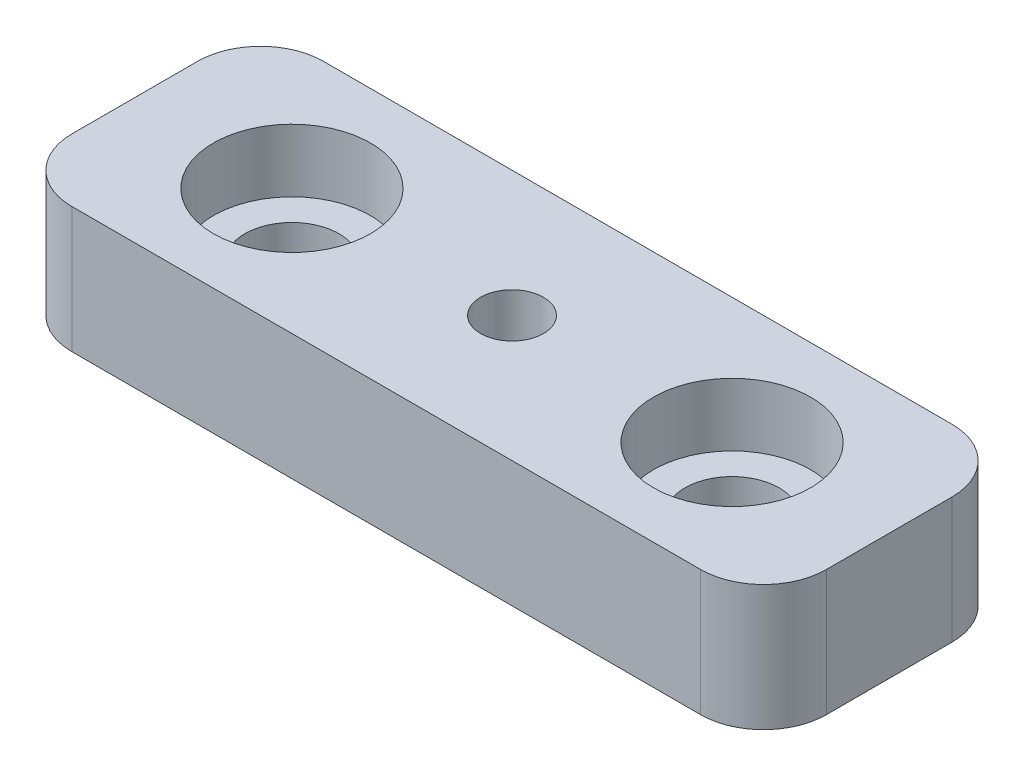
ISO-10303-21;
HEADER;
FILE_DESCRIPTION(('STEP AP214'),'2;1');
FILE_NAME('part.step','',(''),(''),'','','');
FILE_SCHEMA(('AUTOMOTIVE_DESIGN { 1 0 10303 214 1 1 1 1 }'));
ENDSEC;
DATA;
#1=APPLICATION_CONTEXT('core data for automotive mechanical design processes');
#2=APPLICATION_PROTOCOL_DEFINITION('international standard','automotive_design',2000,#1);
#3=PRODUCT_CONTEXT('',#1,'mechanical');
#4=PRODUCT('Part','Part','',(#3));
#5=PRODUCT_RELATED_PRODUCT_CATEGORY('part','',(#4));
#6=PRODUCT_DEFINITION_FORMATION('','',#4);
#7=PRODUCT_DEFINITION_CONTEXT('part definition',#1,'design');
#8=PRODUCT_DEFINITION('design','',#6,#7);
#9=PRODUCT_DEFINITION_SHAPE('','',#8);
#10=(LENGTH_UNIT() NAMED_UNIT(*) SI_UNIT(.MILLI.,.METRE.));
#11=(NAMED_UNIT(*) PLANE_ANGLE_UNIT() SI_UNIT($,.RADIAN.));
#12=(NAMED_UNIT(*) SI_UNIT($,.STERADIAN.) SOLID_ANGLE_UNIT());
#13=UNCERTAINTY_MEASURE_WITH_UNIT(LENGTH_MEASURE(1.E-05),#10,'distance_accuracy_value','');
#14=(GEOMETRIC_REPRESENTATION_CONTEXT(3) GLOBAL_UNCERTAINTY_ASSIGNED_CONTEXT((#13)) GLOBAL_UNIT_ASSIGNED_CONTEXT((#10,
#11,#12)) REPRESENTATION_CONTEXT('',''));
#15=CARTESIAN_POINT('',(0.,0.,0.));
#16=DIRECTION('',(0.,0.,1.));
#17=DIRECTION('',(1.,0.,0.));
#18=AXIS2_PLACEMENT_3D('',#15,#16,#17);
#19=CARTESIAN_POINT('',(-7.,4.001,0.));
#20=DIRECTION('',(0.,-1.,0.));
#21=DIRECTION('',(0.,0.,-1.));
#22=AXIS2_PLACEMENT_3D('',#19,#20,#21);
#23=CYLINDRICAL_SURFACE('',#22,1.5);
#24=CARTESIAN_POINT('',(-7.,0.,0.));
#25=DIRECTION('',(0.,1.,0.));
#26=DIRECTION('',(0.,0.,1.));
#27=AXIS2_PLACEMENT_3D('',#24,#25,#26);
#28=CIRCLE('',#27,1.5);
#29=CARTESIAN_POINT('',(-7.,0.,1.5));
#30=VERTEX_POINT('',#29);
#31=EDGE_CURVE('E190',#30,#30,#28,.T.);
#32=ORIENTED_EDGE('',*,*,#31,.F.);
#33=EDGE_LOOP('',(#32));
#34=FACE_BOUND('',#33,.T.);
#35=CARTESIAN_POINT('',(-7.,2.,0.));
#36=DIRECTION('',(0.,1.,0.));
#37=DIRECTION('',(0.,0.,1.));
#38=AXIS2_PLACEMENT_3D('',#35,#36,#37);
#39=CIRCLE('',#38,1.5);
#40=CARTESIAN_POINT('',(-7.,2.,1.5));
#41=VERTEX_POINT('',#40);
#42=EDGE_CURVE('E40',#41,#41,#39,.T.);
#43=ORIENTED_EDGE('',*,*,#42,.T.);
#44=EDGE_LOOP('',(#43));
#45=FACE_BOUND('',#44,.T.);
#46=ADVANCED_FACE('F36',(#34,#45),#23,.F.);
#47=CARTESIAN_POINT('',(7.,4.001,0.));
#48=DIRECTION('',(0.,-1.,0.));
#49=DIRECTION('',(0.,0.,-1.));
#50=AXIS2_PLACEMENT_3D('',#47,#48,#49);
#51=CYLINDRICAL_SURFACE('',#50,1.5);
#52=CARTESIAN_POINT('',(7.,0.,0.));
#53=DIRECTION('',(0.,-1.,0.));
#54=DIRECTION('',(0.,0.,-1.));
#55=AXIS2_PLACEMENT_3D('',#52,#53,#54);
#56=CIRCLE('',#55,1.5);
#57=CARTESIAN_POINT('',(7.,0.,-1.5));
#58=VERTEX_POINT('',#57);
#59=EDGE_CURVE('E163',#58,#58,#56,.T.);
#60=ORIENTED_EDGE('',*,*,#59,.T.);
#61=EDGE_LOOP('',(#60));
#62=FACE_BOUND('',#61,.T.);
#63=CARTESIAN_POINT('',(7.,2.,0.));
#64=DIRECTION('',(0.,1.,0.));
#65=DIRECTION('',(0.,0.,1.));
#66=AXIS2_PLACEMENT_3D('',#63,#64,#65);
#67=CIRCLE('',#66,1.5);
#68=CARTESIAN_POINT('',(7.,2.,1.5));
#69=VERTEX_POINT('',#68);
#70=EDGE_CURVE('E165',#69,#69,#67,.F.);
#71=ORIENTED_EDGE('',*,*,#70,.F.);
#72=EDGE_LOOP('',(#71));
#73=FACE_BOUND('',#72,.T.);
#74=ADVANCED_FACE('F230',(#62,#73),#51,.F.);
#75=CARTESIAN_POINT('',(-10.,4.,2.));
#76=DIRECTION('',(0.,-1.,0.));
#77=DIRECTION('',(0.,0.,-1.));
#78=AXIS2_PLACEMENT_3D('',#75,#76,#77);
#79=PLANE('',#78);
#80=CARTESIAN_POINT('',(-7.,4.,0.));
#81=DIRECTION('',(0.,1.,0.));
#82=DIRECTION('',(0.,0.,1.));
#83=AXIS2_PLACEMENT_3D('',#80,#81,#82);
#84=CIRCLE('',#83,2.5);
#85=CARTESIAN_POINT('',(-7.,4.,2.5));
#86=VERTEX_POINT('',#85);
#87=EDGE_CURVE('E173',#86,#86,#84,.T.);
#88=ORIENTED_EDGE('',*,*,#87,.F.);
#89=EDGE_LOOP('',(#88));
#90=FACE_BOUND('',#89,.T.);
#91=CARTESIAN_POINT('',(7.,4.,0.));
#92=DIRECTION('',(0.,1.,0.));
#93=DIRECTION('',(0.,0.,1.));
#94=AXIS2_PLACEMENT_3D('',#91,#92,#93);
#95=CIRCLE('',#94,2.5);
#96=CARTESIAN_POINT('',(7.,4.,2.5));
#97=VERTEX_POINT('',#96);
#98=EDGE_CURVE('E183',#97,#97,#95,.T.);
#99=ORIENTED_EDGE('',*,*,#98,.F.);
#100=EDGE_LOOP('',(#99));
#101=FACE_BOUND('',#100,.T.);
#102=DIRECTION('',(-1.,0.,0.));
#103=VECTOR('',#102,1.);
#104=CARTESIAN_POINT('',(10.,4.,4.));
#105=LINE('',#104,#103);
#106=CARTESIAN_POINT('',(10.,4.,4.));
#107=VERTEX_POINT('',#106);
#108=CARTESIAN_POINT('',(-10.,4.,4.));
#109=VERTEX_POINT('',#108);
#110=EDGE_CURVE('E90',#107,#109,#105,.T.);
#111=ORIENTED_EDGE('',*,*,#110,.F.);
#112=CARTESIAN_POINT('',(10.,4.,2.));
#113=DIRECTION('',(0.,1.,0.));
#114=DIRECTION('',(0.,0.,1.));
#115=AXIS2_PLACEMENT_3D('',#112,#113,#114);
#116=CIRCLE('',#115,2.);
#117=CARTESIAN_POINT('',(12.,4.,2.));
#118=VERTEX_POINT('',#117);
#119=EDGE_CURVE('E126',#107,#118,#116,.T.);
#120=ORIENTED_EDGE('',*,*,#119,.T.);
#121=DIRECTION('',(0.,0.,1.));
#122=VECTOR('',#121,1.);
#123=CARTESIAN_POINT('',(12.,4.,-2.));
#124=LINE('',#123,#122);
#125=CARTESIAN_POINT('',(12.,4.,-2.));
#126=VERTEX_POINT('',#125);
#127=EDGE_CURVE('E108',#126,#118,#124,.T.);
#128=ORIENTED_EDGE('',*,*,#127,.F.);
#129=CARTESIAN_POINT('',(10.,4.,-2.));
#130=DIRECTION('',(0.,1.,0.));
#131=DIRECTION('',(0.,0.,1.));
#132=AXIS2_PLACEMENT_3D('',#129,#130,#131);
#133=CIRCLE('',#132,2.);
#134=CARTESIAN_POINT('',(10.,4.,-4.));
#135=VERTEX_POINT('',#134);
#136=EDGE_CURVE('E118',#126,#135,#133,.T.);
#137=ORIENTED_EDGE('',*,*,#136,.T.);
#138=DIRECTION('',(1.,0.,0.));
#139=VECTOR('',#138,1.);
#140=CARTESIAN_POINT('',(-10.,4.,-4.));
#141=LINE('',#140,#139);
#142=CARTESIAN_POINT('',(-10.,4.,-4.));
#143=VERTEX_POINT('',#142);
#144=EDGE_CURVE('E122',#143,#135,#141,.T.);
#145=ORIENTED_EDGE('',*,*,#144,.F.);
#146=CARTESIAN_POINT('',(-10.,4.,-2.));
#147=DIRECTION('',(0.,1.,0.));
#148=DIRECTION('',(0.,0.,1.));
#149=AXIS2_PLACEMENT_3D('',#146,#147,#148);
#150=CIRCLE('',#149,2.);
#151=CARTESIAN_POINT('',(-12.,4.,-2.));
#152=VERTEX_POINT('',#151);
#153=EDGE_CURVE('E204',#143,#152,#150,.T.);
#154=ORIENTED_EDGE('',*,*,#153,.T.);
#155=DIRECTION('',(0.,0.,-1.));
#156=VECTOR('',#155,1.);
#157=CARTESIAN_POINT('',(-12.,4.,2.));
#158=LINE('',#157,#156);
#159=CARTESIAN_POINT('',(-12.,4.,2.));
#160=VERTEX_POINT('',#159);
#161=EDGE_CURVE('E201',#160,#152,#158,.T.);
#162=ORIENTED_EDGE('',*,*,#161,.F.);
#163=CARTESIAN_POINT('',(-10.,4.,2.));
#164=DIRECTION('',(0.,-1.,0.));
#165=DIRECTION('',(0.,0.,-1.));
#166=AXIS2_PLACEMENT_3D('',#163,#164,#165);
#167=CIRCLE('',#166,2.);
#168=EDGE_CURVE('E198',#109,#160,#167,.T.);
#169=ORIENTED_EDGE('',*,*,#168,.F.);
#170=EDGE_LOOP('',(#111,#120,#128,#137,#145,#154,#162,#169));
#171=FACE_BOUND('',#170,.T.);
#172=CARTESIAN_POINT('',(0.,4.,0.));
#173=DIRECTION('',(0.,-1.,0.));
#174=DIRECTION('',(0.,0.,-1.));
#175=AXIS2_PLACEMENT_3D('',#172,#173,#174);
#176=CIRCLE('',#175,1.);
#177=CARTESIAN_POINT('',(0.,4.,-1.));
#178=VERTEX_POINT('',#177);
#179=EDGE_CURVE('E134',#178,#178,#176,.T.);
#180=ORIENTED_EDGE('',*,*,#179,.T.);
#181=EDGE_LOOP('',(#180));
#182=FACE_BOUND('',#181,.T.);
#183=ADVANCED_FACE('F124',(#90,#101,#171,#182),#79,.F.);
#184=CARTESIAN_POINT('',(-10.,0.,2.));
#185=DIRECTION('',(0.,-1.,0.));
#186=DIRECTION('',(0.,0.,-1.));
#187=AXIS2_PLACEMENT_3D('',#184,#185,#186);
#188=PLANE('',#187);
#189=CARTESIAN_POINT('',(0.,0.,0.));
#190=DIRECTION('',(0.,1.,0.));
#191=DIRECTION('',(0.,0.,1.));
#192=AXIS2_PLACEMENT_3D('',#189,#190,#191);
#193=CIRCLE('',#192,2.5);
#194=CARTESIAN_POINT('',(0.,0.,2.5));
#195=VERTEX_POINT('',#194);
#196=EDGE_CURVE('E171',#195,#195,#193,.T.);
#197=ORIENTED_EDGE('',*,*,#196,.T.);
#198=EDGE_LOOP('',(#197));
#199=FACE_BOUND('',#198,.T.);
#200=ORIENTED_EDGE('',*,*,#31,.T.);
#201=EDGE_LOOP('',(#200));
#202=FACE_BOUND('',#201,.T.);
#203=CARTESIAN_POINT('',(10.,0.,2.));
#204=DIRECTION('',(0.,1.,0.));
#205=DIRECTION('',(0.,0.,1.));
#206=AXIS2_PLACEMENT_3D('',#203,#204,#205);
#207=CIRCLE('',#206,2.);
#208=CARTESIAN_POINT('',(10.,0.,4.));
#209=VERTEX_POINT('',#208);
#210=CARTESIAN_POINT('',(12.,0.,2.));
#211=VERTEX_POINT('',#210);
#212=EDGE_CURVE('E149',#209,#211,#207,.T.);
#213=ORIENTED_EDGE('',*,*,#212,.F.);
#214=DIRECTION('',(-1.,0.,0.));
#215=VECTOR('',#214,1.);
#216=CARTESIAN_POINT('',(0.,0.,4.));
#217=LINE('',#216,#215);
#218=CARTESIAN_POINT('',(-10.,0.,4.));
#219=VERTEX_POINT('',#218);
#220=EDGE_CURVE('E86',#209,#219,#217,.T.);
#221=ORIENTED_EDGE('',*,*,#220,.T.);
#222=CARTESIAN_POINT('',(-10.,0.,2.));
#223=DIRECTION('',(0.,-1.,0.));
#224=DIRECTION('',(0.,0.,-1.));
#225=AXIS2_PLACEMENT_3D('',#222,#223,#224);
#226=CIRCLE('',#225,2.);
#227=CARTESIAN_POINT('',(-12.,0.,2.));
#228=VERTEX_POINT('',#227);
#229=EDGE_CURVE('E133',#219,#228,#226,.T.);
#230=ORIENTED_EDGE('',*,*,#229,.T.);
#231=DIRECTION('',(0.,0.,-1.));
#232=VECTOR('',#231,1.);
#233=CARTESIAN_POINT('',(-12.,0.,2.));
#234=LINE('',#233,#232);
#235=CARTESIAN_POINT('',(-12.,0.,-2.));
#236=VERTEX_POINT('',#235);
#237=EDGE_CURVE('E137',#228,#236,#234,.T.);
#238=ORIENTED_EDGE('',*,*,#237,.T.);
#239=CARTESIAN_POINT('',(-10.,0.,-2.));
#240=DIRECTION('',(0.,1.,0.));
#241=DIRECTION('',(0.,0.,1.));
#242=AXIS2_PLACEMENT_3D('',#239,#240,#241);
#243=CIRCLE('',#242,2.);
#244=CARTESIAN_POINT('',(-10.,0.,-4.));
#245=VERTEX_POINT('',#244);
#246=EDGE_CURVE('E140',#245,#236,#243,.T.);
#247=ORIENTED_EDGE('',*,*,#246,.F.);
#248=DIRECTION('',(1.,0.,0.));
#249=VECTOR('',#248,1.);
#250=CARTESIAN_POINT('',(0.,0.,-4.));
#251=LINE('',#250,#249);
#252=CARTESIAN_POINT('',(10.,0.,-4.));
#253=VERTEX_POINT('',#252);
#254=EDGE_CURVE('E143',#245,#253,#251,.T.);
#255=ORIENTED_EDGE('',*,*,#254,.T.);
#256=CARTESIAN_POINT('',(10.,0.,-2.));
#257=DIRECTION('',(0.,1.,0.));
#258=DIRECTION('',(0.,0.,1.));
#259=AXIS2_PLACEMENT_3D('',#256,#257,#258);
#260=CIRCLE('',#259,2.);
#261=CARTESIAN_POINT('',(12.,0.,-2.));
#262=VERTEX_POINT('',#261);
#263=EDGE_CURVE('E146',#262,#253,#260,.T.);
#264=ORIENTED_EDGE('',*,*,#263,.F.);
#265=DIRECTION('',(0.,0.,1.));
#266=VECTOR('',#265,1.);
#267=CARTESIAN_POINT('',(12.,0.,-2.));
#268=LINE('',#267,#266);
#269=EDGE_CURVE('E110',#262,#211,#268,.T.);
#270=ORIENTED_EDGE('',*,*,#269,.T.);
#271=EDGE_LOOP('',(#213,#221,#230,#238,#247,#255,#264,#270));
#272=FACE_BOUND('',#271,.T.);
#273=ORIENTED_EDGE('',*,*,#59,.F.);
#274=EDGE_LOOP('',(#273));
#275=FACE_BOUND('',#274,.T.);
#276=ADVANCED_FACE('F245',(#199,#202,#272,#275),#188,.T.);
#277=CARTESIAN_POINT('',(10.,4.,2.));
#278=DIRECTION('',(0.,-1.,0.));
#279=DIRECTION('',(0.,0.,-1.));
#280=AXIS2_PLACEMENT_3D('',#277,#278,#279);
#281=CYLINDRICAL_SURFACE('',#280,2.);
#282=ORIENTED_EDGE('',*,*,#212,.T.);
#283=DIRECTION('',(0.,-1.,0.));
#284=VECTOR('',#283,1.);
#285=CARTESIAN_POINT('',(12.,4.,2.));
#286=LINE('',#285,#284);
#287=EDGE_CURVE('E46',#118,#211,#286,.T.);
#288=ORIENTED_EDGE('',*,*,#287,.F.);
#289=ORIENTED_EDGE('',*,*,#119,.F.);
#290=DIRECTION('',(0.,-1.,0.));
#291=VECTOR('',#290,1.);
#292=CARTESIAN_POINT('',(10.,4.,4.));
#293=LINE('',#292,#291);
#294=EDGE_CURVE('E11',#107,#209,#293,.T.);
#295=ORIENTED_EDGE('',*,*,#294,.T.);
#296=EDGE_LOOP('',(#282,#288,#289,#295));
#297=FACE_BOUND('',#296,.T.);
#298=ADVANCED_FACE('F249',(#297),#281,.T.);
#299=CARTESIAN_POINT('',(12.,4.,-2.));
#300=DIRECTION('',(1.,0.,0.));
#301=DIRECTION('',(0.,0.,-1.));
#302=AXIS2_PLACEMENT_3D('',#299,#300,#301);
#303=PLANE('',#302);
#304=ORIENTED_EDGE('',*,*,#269,.F.);
#305=DIRECTION('',(0.,-1.,0.));
#306=VECTOR('',#305,1.);
#307=CARTESIAN_POINT('',(12.,4.,-2.));
#308=LINE('',#307,#306);
#309=EDGE_CURVE('E104',#126,#262,#308,.T.);
#310=ORIENTED_EDGE('',*,*,#309,.F.);
#311=ORIENTED_EDGE('',*,*,#127,.T.);
#312=ORIENTED_EDGE('',*,*,#287,.T.);
#313=EDGE_LOOP('',(#304,#310,#311,#312));
#314=FACE_BOUND('',#313,.T.);
#315=ADVANCED_FACE('F106',(#314),#303,.T.);
#316=CARTESIAN_POINT('',(10.,4.,-2.));
#317=DIRECTION('',(0.,-1.,0.));
#318=DIRECTION('',(0.,0.,-1.));
#319=AXIS2_PLACEMENT_3D('',#316,#317,#318);
#320=CYLINDRICAL_SURFACE('',#319,2.);
#321=ORIENTED_EDGE('',*,*,#263,.T.);
#322=DIRECTION('',(0.,-1.,0.));
#323=VECTOR('',#322,1.);
#324=CARTESIAN_POINT('',(10.,4.,-4.));
#325=LINE('',#324,#323);
#326=EDGE_CURVE('E114',#135,#253,#325,.T.);
#327=ORIENTED_EDGE('',*,*,#326,.F.);
#328=ORIENTED_EDGE('',*,*,#136,.F.);
#329=ORIENTED_EDGE('',*,*,#309,.T.);
#330=EDGE_LOOP('',(#321,#327,#328,#329));
#331=FACE_BOUND('',#330,.T.);
#332=ADVANCED_FACE('F119',(#331),#320,.T.);
#333=CARTESIAN_POINT('',(0.,4.,-4.));
#334=DIRECTION('',(0.,0.,-1.));
#335=DIRECTION('',(-1.,0.,0.));
#336=AXIS2_PLACEMENT_3D('',#333,#334,#335);
#337=PLANE('',#336);
#338=ORIENTED_EDGE('',*,*,#254,.F.);
#339=DIRECTION('',(0.,-1.,0.));
#340=VECTOR('',#339,1.);
#341=CARTESIAN_POINT('',(-10.,4.,-4.));
#342=LINE('',#341,#340);
#343=EDGE_CURVE('E153',#143,#245,#342,.T.);
#344=ORIENTED_EDGE('',*,*,#343,.F.);
#345=ORIENTED_EDGE('',*,*,#144,.T.);
#346=ORIENTED_EDGE('',*,*,#326,.T.);
#347=EDGE_LOOP('',(#338,#344,#345,#346));
#348=FACE_BOUND('',#347,.T.);
#349=ADVANCED_FACE('F206',(#348),#337,.T.);
#350=CARTESIAN_POINT('',(-10.,4.,-2.));
#351=DIRECTION('',(0.,-1.,0.));
#352=DIRECTION('',(0.,0.,-1.));
#353=AXIS2_PLACEMENT_3D('',#350,#351,#352);
#354=CYLINDRICAL_SURFACE('',#353,2.);
#355=ORIENTED_EDGE('',*,*,#246,.T.);
#356=DIRECTION('',(0.,-1.,0.));
#357=VECTOR('',#356,1.);
#358=CARTESIAN_POINT('',(-12.,4.,-2.));
#359=LINE('',#358,#357);
#360=EDGE_CURVE('E156',#152,#236,#359,.T.);
#361=ORIENTED_EDGE('',*,*,#360,.F.);
#362=ORIENTED_EDGE('',*,*,#153,.F.);
#363=ORIENTED_EDGE('',*,*,#343,.T.);
#364=EDGE_LOOP('',(#355,#361,#362,#363));
#365=FACE_BOUND('',#364,.T.);
#366=ADVANCED_FACE('F212',(#365),#354,.T.);
#367=CARTESIAN_POINT('',(-12.,4.,2.));
#368=DIRECTION('',(-1.,0.,0.));
#369=DIRECTION('',(0.,0.,1.));
#370=AXIS2_PLACEMENT_3D('',#367,#368,#369);
#371=PLANE('',#370);
#372=ORIENTED_EDGE('',*,*,#237,.F.);
#373=DIRECTION('',(0.,-1.,0.));
#374=VECTOR('',#373,1.);
#375=CARTESIAN_POINT('',(-12.,4.,2.));
#376=LINE('',#375,#374);
#377=EDGE_CURVE('E158',#160,#228,#376,.T.);
#378=ORIENTED_EDGE('',*,*,#377,.F.);
#379=ORIENTED_EDGE('',*,*,#161,.T.);
#380=ORIENTED_EDGE('',*,*,#360,.T.);
#381=EDGE_LOOP('',(#372,#378,#379,#380));
#382=FACE_BOUND('',#381,.T.);
#383=ADVANCED_FACE('F216',(#382),#371,.T.);
#384=CARTESIAN_POINT('',(-10.,4.,2.));
#385=DIRECTION('',(0.,-1.,0.));
#386=DIRECTION('',(0.,0.,-1.));
#387=AXIS2_PLACEMENT_3D('',#384,#385,#386);
#388=CYLINDRICAL_SURFACE('',#387,2.);
#389=ORIENTED_EDGE('',*,*,#229,.F.);
#390=DIRECTION('',(0.,-1.,0.));
#391=VECTOR('',#390,1.);
#392=CARTESIAN_POINT('',(-10.,4.,4.));
#393=LINE('',#392,#391);
#394=EDGE_CURVE('E128',#109,#219,#393,.T.);
#395=ORIENTED_EDGE('',*,*,#394,.F.);
#396=ORIENTED_EDGE('',*,*,#168,.T.);
#397=ORIENTED_EDGE('',*,*,#377,.T.);
#398=EDGE_LOOP('',(#389,#395,#396,#397));
#399=FACE_BOUND('',#398,.T.);
#400=ADVANCED_FACE('F219',(#399),#388,.T.);
#401=CARTESIAN_POINT('',(0.,4.,4.));
#402=DIRECTION('',(0.,0.,1.));
#403=DIRECTION('',(1.,0.,0.));
#404=AXIS2_PLACEMENT_3D('',#401,#402,#403);
#405=PLANE('',#404);
#406=ORIENTED_EDGE('',*,*,#220,.F.);
#407=ORIENTED_EDGE('',*,*,#294,.F.);
#408=ORIENTED_EDGE('',*,*,#110,.T.);
#409=ORIENTED_EDGE('',*,*,#394,.T.);
#410=EDGE_LOOP('',(#406,#407,#408,#409));
#411=FACE_BOUND('',#410,.T.);
#412=ADVANCED_FACE('F38',(#411),#405,.T.);
#413=CARTESIAN_POINT('',(0.,4.001,0.));
#414=DIRECTION('',(0.,-1.,0.));
#415=DIRECTION('',(0.,0.,-1.));
#416=AXIS2_PLACEMENT_3D('',#413,#414,#415);
#417=CYLINDRICAL_SURFACE('',#416,1.);
#418=CARTESIAN_POINT('',(0.,2.,0.));
#419=DIRECTION('',(0.,1.,0.));
#420=DIRECTION('',(0.,0.,1.));
#421=AXIS2_PLACEMENT_3D('',#418,#419,#420);
#422=CIRCLE('',#421,1.);
#423=CARTESIAN_POINT('',(0.,2.,1.));
#424=VERTEX_POINT('',#423);
#425=EDGE_CURVE('E161',#424,#424,#422,.T.);
#426=ORIENTED_EDGE('',*,*,#425,.F.);
#427=EDGE_LOOP('',(#426));
#428=FACE_BOUND('',#427,.T.);
#429=ORIENTED_EDGE('',*,*,#179,.F.);
#430=EDGE_LOOP('',(#429));
#431=FACE_BOUND('',#430,.T.);
#432=ADVANCED_FACE('F221',(#428,#431),#417,.F.);
#433=CARTESIAN_POINT('',(0.,2.,0.));
#434=DIRECTION('',(0.,-1.,0.));
#435=DIRECTION('',(0.,0.,-1.));
#436=AXIS2_PLACEMENT_3D('',#433,#434,#435);
#437=CYLINDRICAL_SURFACE('',#436,2.5);
#438=CARTESIAN_POINT('',(0.,2.,0.));
#439=DIRECTION('',(0.,1.,0.));
#440=DIRECTION('',(0.,0.,1.));
#441=AXIS2_PLACEMENT_3D('',#438,#439,#440);
#442=CIRCLE('',#441,2.5);
#443=CARTESIAN_POINT('',(0.,2.,2.5));
#444=VERTEX_POINT('',#443);
#445=EDGE_CURVE('E164',#444,#444,#442,.T.);
#446=ORIENTED_EDGE('',*,*,#445,.T.);
#447=EDGE_LOOP('',(#446));
#448=FACE_BOUND('',#447,.T.);
#449=ORIENTED_EDGE('',*,*,#196,.F.);
#450=EDGE_LOOP('',(#449));
#451=FACE_BOUND('',#450,.T.);
#452=ADVANCED_FACE('F226',(#448,#451),#437,.F.);
#453=CARTESIAN_POINT('',(0.,2.,0.));
#454=DIRECTION('',(0.,1.,0.));
#455=DIRECTION('',(0.,0.,1.));
#456=AXIS2_PLACEMENT_3D('',#453,#454,#455);
#457=PLANE('',#456);
#458=ORIENTED_EDGE('',*,*,#425,.T.);
#459=EDGE_LOOP('',(#458));
#460=FACE_BOUND('',#459,.T.);
#461=ORIENTED_EDGE('',*,*,#445,.F.);
#462=EDGE_LOOP('',(#461));
#463=FACE_BOUND('',#462,.T.);
#464=ADVANCED_FACE('F298',(#460,#463),#457,.F.);
#465=CARTESIAN_POINT('',(7.,2.,0.));
#466=DIRECTION('',(0.,1.,0.));
#467=DIRECTION('',(0.,0.,1.));
#468=AXIS2_PLACEMENT_3D('',#465,#466,#467);
#469=PLANE('',#468);
#470=CARTESIAN_POINT('',(7.,2.,0.));
#471=DIRECTION('',(0.,1.,0.));
#472=DIRECTION('',(0.,0.,1.));
#473=AXIS2_PLACEMENT_3D('',#470,#471,#472);
#474=CIRCLE('',#473,2.5);
#475=CARTESIAN_POINT('',(7.,2.,2.5));
#476=VERTEX_POINT('',#475);
#477=EDGE_CURVE('E178',#476,#476,#474,.T.);
#478=ORIENTED_EDGE('',*,*,#477,.T.);
#479=EDGE_LOOP('',(#478));
#480=FACE_BOUND('',#479,.T.);
#481=ORIENTED_EDGE('',*,*,#70,.T.);
#482=EDGE_LOOP('',(#481));
#483=FACE_BOUND('',#482,.T.);
#484=ADVANCED_FACE('F306',(#480,#483),#469,.T.);
#485=CARTESIAN_POINT('',(7.,2.,0.));
#486=DIRECTION('',(0.,1.,0.));
#487=DIRECTION('',(0.,0.,1.));
#488=AXIS2_PLACEMENT_3D('',#485,#486,#487);
#489=CYLINDRICAL_SURFACE('',#488,2.5);
#490=ORIENTED_EDGE('',*,*,#477,.F.);
#491=EDGE_LOOP('',(#490));
#492=FACE_BOUND('',#491,.T.);
#493=ORIENTED_EDGE('',*,*,#98,.T.);
#494=EDGE_LOOP('',(#493));
#495=FACE_BOUND('',#494,.T.);
#496=ADVANCED_FACE('F331',(#492,#495),#489,.F.);
#497=CARTESIAN_POINT('',(-7.,2.,0.));
#498=DIRECTION('',(0.,1.,0.));
#499=DIRECTION('',(0.,0.,1.));
#500=AXIS2_PLACEMENT_3D('',#497,#498,#499);
#501=CYLINDRICAL_SURFACE('',#500,2.5);
#502=CARTESIAN_POINT('',(-7.,2.,0.));
#503=DIRECTION('',(0.,1.,0.));
#504=DIRECTION('',(0.,0.,1.));
#505=AXIS2_PLACEMENT_3D('',#502,#503,#504);
#506=CIRCLE('',#505,2.5);
#507=CARTESIAN_POINT('',(-7.,2.,2.5));
#508=VERTEX_POINT('',#507);
#509=EDGE_CURVE('E167',#508,#508,#506,.T.);
#510=ORIENTED_EDGE('',*,*,#509,.F.);
#511=EDGE_LOOP('',(#510));
#512=FACE_BOUND('',#511,.T.);
#513=ORIENTED_EDGE('',*,*,#87,.T.);
#514=EDGE_LOOP('',(#513));
#515=FACE_BOUND('',#514,.T.);
#516=ADVANCED_FACE('F341',(#512,#515),#501,.F.);
#517=CARTESIAN_POINT('',(-7.,2.,0.));
#518=DIRECTION('',(0.,1.,0.));
#519=DIRECTION('',(0.,0.,1.));
#520=AXIS2_PLACEMENT_3D('',#517,#518,#519);
#521=PLANE('',#520);
#522=ORIENTED_EDGE('',*,*,#42,.F.);
#523=EDGE_LOOP('',(#522));
#524=FACE_BOUND('',#523,.T.);
#525=ORIENTED_EDGE('',*,*,#509,.T.);
#526=EDGE_LOOP('',(#525));
#527=FACE_BOUND('',#526,.T.);
#528=ADVANCED_FACE('F351',(#524,#527),#521,.T.);
#529=CLOSED_SHELL('',(#46,#74,#183,#276,#298,#315,#332,#349,#366,#383,#400,#412,#432,#452,#464,
#484,#496,#516,#528));
#530=MANIFOLD_SOLID_BREP('B2',#529);
#531=ADVANCED_BREP_SHAPE_REPRESENTATION('',(#18,#530),#14);
#532=SHAPE_DEFINITION_REPRESENTATION(#9,#531);
ENDSEC;
END-ISO-10303-21;
